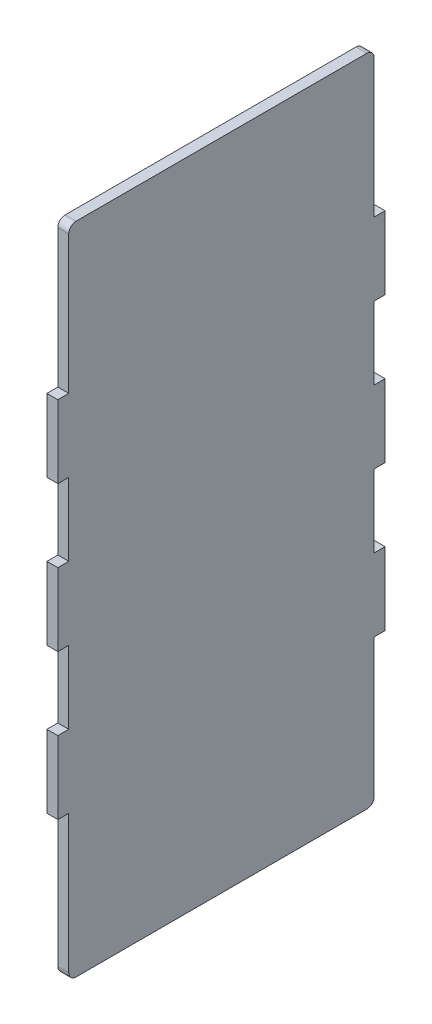
ISO-10303-21;
HEADER;
FILE_DESCRIPTION(('STEP AP214'),'2;1');
FILE_NAME('part.step','',(''),(''),'','','');
FILE_SCHEMA(('AUTOMOTIVE_DESIGN { 1 0 10303 214 1 1 1 1 }'));
ENDSEC;
DATA;
#1=APPLICATION_CONTEXT('core data for automotive mechanical design processes');
#2=APPLICATION_PROTOCOL_DEFINITION('international standard','automotive_design',2000,#1);
#3=PRODUCT_CONTEXT('',#1,'mechanical');
#4=PRODUCT('Part','Part','',(#3));
#5=PRODUCT_RELATED_PRODUCT_CATEGORY('part','',(#4));
#6=PRODUCT_DEFINITION_FORMATION('','',#4);
#7=PRODUCT_DEFINITION_CONTEXT('part definition',#1,'design');
#8=PRODUCT_DEFINITION('design','',#6,#7);
#9=PRODUCT_DEFINITION_SHAPE('','',#8);
#10=(LENGTH_UNIT() NAMED_UNIT(*) SI_UNIT(.MILLI.,.METRE.));
#11=(NAMED_UNIT(*) PLANE_ANGLE_UNIT() SI_UNIT($,.RADIAN.));
#12=(NAMED_UNIT(*) SI_UNIT($,.STERADIAN.) SOLID_ANGLE_UNIT());
#13=UNCERTAINTY_MEASURE_WITH_UNIT(LENGTH_MEASURE(1.E-05),#10,'distance_accuracy_value','');
#14=(GEOMETRIC_REPRESENTATION_CONTEXT(3) GLOBAL_UNCERTAINTY_ASSIGNED_CONTEXT((#13)) GLOBAL_UNIT_ASSIGNED_CONTEXT((#10,
#11,#12)) REPRESENTATION_CONTEXT('',''));
#15=CARTESIAN_POINT('',(0.,0.,0.));
#16=DIRECTION('',(0.,0.,1.));
#17=DIRECTION('',(1.,0.,0.));
#18=AXIS2_PLACEMENT_3D('',#15,#16,#17);
#19=CARTESIAN_POINT('',(0.,0.,1.5));
#20=DIRECTION('',(0.,0.,-1.));
#21=DIRECTION('',(-1.,0.,0.));
#22=AXIS2_PLACEMENT_3D('',#19,#20,#21);
#23=PLANE('',#22);
#24=DIRECTION('',(0.,-1.,0.));
#25=VECTOR('',#24,1.);
#26=CARTESIAN_POINT('',(-90.9148936170213,114.397705984735,1.5));
#27=LINE('',#26,#25);
#28=CARTESIAN_POINT('',(-90.9148936170212,74.3977059847353,1.5));
#29=VERTEX_POINT('',#28);
#30=CARTESIAN_POINT('',(-90.9148936170212,54.3977059847353,1.5));
#31=VERTEX_POINT('',#30);
#32=EDGE_CURVE('E410',#29,#31,#27,.T.);
#33=ORIENTED_EDGE('',*,*,#32,.F.);
#34=DIRECTION('',(1.,0.,0.));
#35=VECTOR('',#34,1.);
#36=CARTESIAN_POINT('',(-94.0048936170213,74.3977059847353,1.5));
#37=LINE('',#36,#35);
#38=CARTESIAN_POINT('',(-93.9148936170212,74.3977059847353,1.5));
#39=VERTEX_POINT('',#38);
#40=EDGE_CURVE('E313',#39,#29,#37,.T.);
#41=ORIENTED_EDGE('',*,*,#40,.F.);
#42=DIRECTION('',(0.,-1.,0.));
#43=VECTOR('',#42,1.);
#44=CARTESIAN_POINT('',(-93.9148936170213,114.397705984735,1.5));
#45=LINE('',#44,#43);
#46=CARTESIAN_POINT('',(-93.9148936170212,54.3977059847353,1.5));
#47=VERTEX_POINT('',#46);
#48=EDGE_CURVE('E405',#39,#47,#45,.T.);
#49=ORIENTED_EDGE('',*,*,#48,.T.);
#50=DIRECTION('',(-1.,0.,0.));
#51=VECTOR('',#50,1.);
#52=CARTESIAN_POINT('',(-90.8248936170213,54.3977059847353,1.5));
#53=LINE('',#52,#51);
#54=EDGE_CURVE('E306',#31,#47,#53,.T.);
#55=ORIENTED_EDGE('',*,*,#54,.F.);
#56=EDGE_LOOP('',(#33,#41,#49,#55));
#57=FACE_BOUND('',#56,.T.);
#58=ADVANCED_FACE('F33',(#57),#23,.F.);
#59=CARTESIAN_POINT('',(-93.9148936170212,34.3977059847353,1.5));
#60=VERTEX_POINT('',#59);
#61=CARTESIAN_POINT('',(-93.9148936170212,14.3977059847353,1.5));
#62=VERTEX_POINT('',#61);
#63=EDGE_CURVE('E404',#60,#62,#45,.T.);
#64=ORIENTED_EDGE('',*,*,#63,.T.);
#65=DIRECTION('',(-1.,0.,0.));
#66=VECTOR('',#65,1.);
#67=CARTESIAN_POINT('',(-90.8248936170212,14.3977059847353,1.5));
#68=LINE('',#67,#66);
#69=CARTESIAN_POINT('',(-90.9148936170212,14.3977059847353,1.5));
#70=VERTEX_POINT('',#69);
#71=EDGE_CURVE('E301',#70,#62,#68,.T.);
#72=ORIENTED_EDGE('',*,*,#71,.F.);
#73=CARTESIAN_POINT('',(-90.9148936170212,34.3977059847353,1.5));
#74=VERTEX_POINT('',#73);
#75=EDGE_CURVE('E409',#74,#70,#27,.T.);
#76=ORIENTED_EDGE('',*,*,#75,.F.);
#77=DIRECTION('',(1.,0.,0.));
#78=VECTOR('',#77,1.);
#79=CARTESIAN_POINT('',(-94.0048936170212,34.3977059847353,1.5));
#80=LINE('',#79,#78);
#81=EDGE_CURVE('E304',#60,#74,#80,.T.);
#82=ORIENTED_EDGE('',*,*,#81,.F.);
#83=EDGE_LOOP('',(#64,#72,#76,#82));
#84=FACE_BOUND('',#83,.T.);
#85=ADVANCED_FACE('F528',(#84),#23,.F.);
#86=CARTESIAN_POINT('',(-90.9148936170212,-65.6022940152647,-268.52499826413));
#87=DIRECTION('',(0.,1.,0.));
#88=DIRECTION('',(0.,0.,1.));
#89=AXIS2_PLACEMENT_3D('',#86,#87,#88);
#90=PLANE('',#89);
#91=DIRECTION('',(0.,0.,1.));
#92=VECTOR('',#91,1.);
#93=CARTESIAN_POINT('',(-90.9148936170212,-65.6022940152647,-268.52499826413));
#94=LINE('',#93,#92);
#95=CARTESIAN_POINT('',(-90.9148936170212,-65.6022940152647,-83.5));
#96=VERTEX_POINT('',#95);
#97=CARTESIAN_POINT('',(-90.9148936170212,-65.6022940152647,-3.5));
#98=VERTEX_POINT('',#97);
#99=EDGE_CURVE('E415',#96,#98,#94,.T.);
#100=ORIENTED_EDGE('',*,*,#99,.T.);
#101=DIRECTION('',(1.,0.,0.));
#102=VECTOR('',#101,1.);
#103=CARTESIAN_POINT('',(-93.9148936170212,-65.6022940152647,-3.5));
#104=LINE('',#103,#102);
#105=CARTESIAN_POINT('',(-93.9148936170212,-65.6022940152647,-3.5));
#106=VERTEX_POINT('',#105);
#107=EDGE_CURVE('E442',#98,#106,#104,.F.);
#108=ORIENTED_EDGE('',*,*,#107,.T.);
#109=DIRECTION('',(0.,0.,1.));
#110=VECTOR('',#109,1.);
#111=CARTESIAN_POINT('',(-93.9148936170212,-65.6022940152647,-268.52499826413));
#112=LINE('',#111,#110);
#113=CARTESIAN_POINT('',(-93.9148936170212,-65.6022940152647,-83.5));
#114=VERTEX_POINT('',#113);
#115=EDGE_CURVE('E418',#114,#106,#112,.T.);
#116=ORIENTED_EDGE('',*,*,#115,.F.);
#117=DIRECTION('',(1.,0.,0.));
#118=VECTOR('',#117,1.);
#119=CARTESIAN_POINT('',(-90.9148936170212,-65.6022940152647,-83.5));
#120=LINE('',#119,#118);
#121=EDGE_CURVE('E439',#114,#96,#120,.T.);
#122=ORIENTED_EDGE('',*,*,#121,.T.);
#123=EDGE_LOOP('',(#100,#108,#116,#122));
#124=FACE_BOUND('',#123,.T.);
#125=ADVANCED_FACE('F535',(#124),#90,.F.);
#126=CARTESIAN_POINT('',(-90.9148936170213,114.397705984735,-268.52499826413));
#127=DIRECTION('',(-1.,0.,0.));
#128=DIRECTION('',(0.,-1.,0.));
#129=AXIS2_PLACEMENT_3D('',#126,#127,#128);
#130=PLANE('',#129);
#131=DIRECTION('',(0.,1.,0.));
#132=VECTOR('',#131,1.);
#133=CARTESIAN_POINT('',(-90.9148936170213,114.397705984735,-1.5));
#134=LINE('',#133,#132);
#135=CARTESIAN_POINT('',(-90.9148936170212,-63.6022940152647,-1.5));
#136=VERTEX_POINT('',#135);
#137=CARTESIAN_POINT('',(-90.9148936170212,-25.6022940152647,-1.5));
#138=VERTEX_POINT('',#137);
#139=EDGE_CURVE('E386',#136,#138,#134,.T.);
#140=ORIENTED_EDGE('',*,*,#139,.F.);
#141=CARTESIAN_POINT('',(-90.9148936170212,-63.6022940152647,-3.5));
#142=DIRECTION('',(-1.,0.,0.));
#143=DIRECTION('',(0.,-1.,0.));
#144=AXIS2_PLACEMENT_3D('',#141,#142,#143);
#145=CIRCLE('',#144,2.);
#146=EDGE_CURVE('E437',#136,#98,#145,.F.);
#147=ORIENTED_EDGE('',*,*,#146,.T.);
#148=ORIENTED_EDGE('',*,*,#99,.F.);
#149=CARTESIAN_POINT('',(-90.9148936170212,-63.6022940152647,-83.5));
#150=DIRECTION('',(-1.,0.,0.));
#151=DIRECTION('',(0.,-1.,0.));
#152=AXIS2_PLACEMENT_3D('',#149,#150,#151);
#153=CIRCLE('',#152,2.);
#154=CARTESIAN_POINT('',(-90.9148936170212,-63.6022940152647,-85.5));
#155=VERTEX_POINT('',#154);
#156=EDGE_CURVE('E435',#96,#155,#153,.F.);
#157=ORIENTED_EDGE('',*,*,#156,.T.);
#158=DIRECTION('',(0.,1.,0.));
#159=VECTOR('',#158,1.);
#160=CARTESIAN_POINT('',(-90.9148936170213,114.397705984735,-85.5));
#161=LINE('',#160,#159);
#162=CARTESIAN_POINT('',(-90.9148936170212,-25.6022940152647,-85.5));
#163=VERTEX_POINT('',#162);
#164=EDGE_CURVE('E391',#155,#163,#161,.T.);
#165=ORIENTED_EDGE('',*,*,#164,.T.);
#166=DIRECTION('',(0.,0.,-1.));
#167=VECTOR('',#166,1.);
#168=CARTESIAN_POINT('',(-90.9148936170212,-25.6022940152647,-268.52499826413));
#169=LINE('',#168,#167);
#170=CARTESIAN_POINT('',(-90.9148936170212,-25.6022940152647,-88.5));
#171=VERTEX_POINT('',#170);
#172=EDGE_CURVE('E351',#163,#171,#169,.T.);
#173=ORIENTED_EDGE('',*,*,#172,.T.);
#174=DIRECTION('',(0.,1.,0.));
#175=VECTOR('',#174,1.);
#176=CARTESIAN_POINT('',(-90.9148936170213,114.397705984735,-88.5));
#177=LINE('',#176,#175);
#178=CARTESIAN_POINT('',(-90.9148936170212,-5.60229401526467,-88.5));
#179=VERTEX_POINT('',#178);
#180=EDGE_CURVE('E397',#171,#179,#177,.T.);
#181=ORIENTED_EDGE('',*,*,#180,.T.);
#182=DIRECTION('',(0.,0.,1.));
#183=VECTOR('',#182,1.);
#184=CARTESIAN_POINT('',(-90.9148936170212,-5.60229401526467,-268.52499826413));
#185=LINE('',#184,#183);
#186=CARTESIAN_POINT('',(-90.9148936170212,-5.60229401526467,-85.5));
#187=VERTEX_POINT('',#186);
#188=EDGE_CURVE('E298',#179,#187,#185,.T.);
#189=ORIENTED_EDGE('',*,*,#188,.T.);
#190=CARTESIAN_POINT('',(-90.9148936170212,14.3977059847353,-85.5));
#191=VERTEX_POINT('',#190);
#192=EDGE_CURVE('E475',#187,#191,#161,.T.);
#193=ORIENTED_EDGE('',*,*,#192,.T.);
#194=DIRECTION('',(0.,0.,-1.));
#195=VECTOR('',#194,1.);
#196=CARTESIAN_POINT('',(-90.9148936170212,14.3977059847353,-268.52499826413));
#197=LINE('',#196,#195);
#198=CARTESIAN_POINT('',(-90.9148936170212,14.3977059847353,-88.5));
#199=VERTEX_POINT('',#198);
#200=EDGE_CURVE('E357',#191,#199,#197,.T.);
#201=ORIENTED_EDGE('',*,*,#200,.T.);
#202=CARTESIAN_POINT('',(-90.9148936170212,34.3977059847354,-88.5));
#203=VERTEX_POINT('',#202);
#204=EDGE_CURVE('E395',#199,#203,#177,.T.);
#205=ORIENTED_EDGE('',*,*,#204,.T.);
#206=DIRECTION('',(0.,0.,1.));
#207=VECTOR('',#206,1.);
#208=CARTESIAN_POINT('',(-90.9148936170212,34.3977059847354,-268.52499826413));
#209=LINE('',#208,#207);
#210=CARTESIAN_POINT('',(-90.9148936170212,34.3977059847353,-85.5));
#211=VERTEX_POINT('',#210);
#212=EDGE_CURVE('E354',#203,#211,#209,.T.);
#213=ORIENTED_EDGE('',*,*,#212,.T.);
#214=CARTESIAN_POINT('',(-90.9148936170212,54.3977059847353,-85.5));
#215=VERTEX_POINT('',#214);
#216=EDGE_CURVE('E390',#211,#215,#161,.T.);
#217=ORIENTED_EDGE('',*,*,#216,.T.);
#218=DIRECTION('',(0.,0.,-1.));
#219=VECTOR('',#218,1.);
#220=CARTESIAN_POINT('',(-90.9148936170212,54.3977059847353,-268.52499826413));
#221=LINE('',#220,#219);
#222=CARTESIAN_POINT('',(-90.9148936170212,54.3977059847353,-88.5));
#223=VERTEX_POINT('',#222);
#224=EDGE_CURVE('E250',#215,#223,#221,.T.);
#225=ORIENTED_EDGE('',*,*,#224,.T.);
#226=CARTESIAN_POINT('',(-90.9148936170212,74.3977059847353,-88.5));
#227=VERTEX_POINT('',#226);
#228=EDGE_CURVE('E392',#223,#227,#177,.T.);
#229=ORIENTED_EDGE('',*,*,#228,.T.);
#230=DIRECTION('',(0.,0.,1.));
#231=VECTOR('',#230,1.);
#232=CARTESIAN_POINT('',(-90.9148936170212,74.3977059847353,-268.52499826413));
#233=LINE('',#232,#231);
#234=CARTESIAN_POINT('',(-90.9148936170212,74.3977059847353,-85.5));
#235=VERTEX_POINT('',#234);
#236=EDGE_CURVE('E361',#227,#235,#233,.T.);
#237=ORIENTED_EDGE('',*,*,#236,.T.);
#238=CARTESIAN_POINT('',(-90.9148936170213,112.397705984735,-85.5));
#239=VERTEX_POINT('',#238);
#240=EDGE_CURVE('E387',#235,#239,#161,.T.);
#241=ORIENTED_EDGE('',*,*,#240,.T.);
#242=CARTESIAN_POINT('',(-90.9148936170213,112.397705984735,-83.5));
#243=DIRECTION('',(-1.,0.,0.));
#244=DIRECTION('',(0.,-1.,0.));
#245=AXIS2_PLACEMENT_3D('',#242,#243,#244);
#246=CIRCLE('',#245,2.);
#247=CARTESIAN_POINT('',(-90.9148936170213,114.397705984735,-83.5));
#248=VERTEX_POINT('',#247);
#249=EDGE_CURVE('E433',#239,#248,#246,.F.);
#250=ORIENTED_EDGE('',*,*,#249,.T.);
#251=DIRECTION('',(0.,0.,1.));
#252=VECTOR('',#251,1.);
#253=CARTESIAN_POINT('',(-90.9148936170213,114.397705984735,-268.52499826413));
#254=LINE('',#253,#252);
#255=CARTESIAN_POINT('',(-90.9148936170213,114.397705984735,-3.5));
#256=VERTEX_POINT('',#255);
#257=EDGE_CURVE('E412',#248,#256,#254,.T.);
#258=ORIENTED_EDGE('',*,*,#257,.T.);
#259=CARTESIAN_POINT('',(-90.9148936170213,112.397705984735,-3.5));
#260=DIRECTION('',(-1.,0.,0.));
#261=DIRECTION('',(0.,-1.,0.));
#262=AXIS2_PLACEMENT_3D('',#259,#260,#261);
#263=CIRCLE('',#262,2.);
#264=CARTESIAN_POINT('',(-90.9148936170213,112.397705984735,-1.5));
#265=VERTEX_POINT('',#264);
#266=EDGE_CURVE('E431',#256,#265,#263,.F.);
#267=ORIENTED_EDGE('',*,*,#266,.T.);
#268=CARTESIAN_POINT('',(-90.9148936170212,74.3977059847353,-1.5));
#269=VERTEX_POINT('',#268);
#270=EDGE_CURVE('E382',#269,#265,#134,.T.);
#271=ORIENTED_EDGE('',*,*,#270,.F.);
#272=DIRECTION('',(0.,0.,1.));
#273=VECTOR('',#272,1.);
#274=CARTESIAN_POINT('',(-90.9148936170212,74.3977059847353,-268.52499826413));
#275=LINE('',#274,#273);
#276=EDGE_CURVE('E379',#269,#29,#275,.T.);
#277=ORIENTED_EDGE('',*,*,#276,.T.);
#278=ORIENTED_EDGE('',*,*,#32,.T.);
#279=DIRECTION('',(0.,0.,-1.));
#280=VECTOR('',#279,1.);
#281=CARTESIAN_POINT('',(-90.9148936170212,54.3977059847353,-268.52499826413));
#282=LINE('',#281,#280);
#283=CARTESIAN_POINT('',(-90.9148936170212,54.3977059847353,-1.5));
#284=VERTEX_POINT('',#283);
#285=EDGE_CURVE('E376',#31,#284,#282,.T.);
#286=ORIENTED_EDGE('',*,*,#285,.T.);
#287=CARTESIAN_POINT('',(-90.9148936170212,34.3977059847353,-1.5));
#288=VERTEX_POINT('',#287);
#289=EDGE_CURVE('E385',#288,#284,#134,.T.);
#290=ORIENTED_EDGE('',*,*,#289,.F.);
#291=DIRECTION('',(0.,0.,1.));
#292=VECTOR('',#291,1.);
#293=CARTESIAN_POINT('',(-90.9148936170212,34.3977059847354,-268.52499826413));
#294=LINE('',#293,#292);
#295=EDGE_CURVE('E370',#288,#74,#294,.T.);
#296=ORIENTED_EDGE('',*,*,#295,.T.);
#297=ORIENTED_EDGE('',*,*,#75,.T.);
#298=DIRECTION('',(0.,0.,-1.));
#299=VECTOR('',#298,1.);
#300=CARTESIAN_POINT('',(-90.9148936170212,14.3977059847353,-268.52499826413));
#301=LINE('',#300,#299);
#302=CARTESIAN_POINT('',(-90.9148936170212,14.3977059847353,-1.5));
#303=VERTEX_POINT('',#302);
#304=EDGE_CURVE('E373',#70,#303,#301,.T.);
#305=ORIENTED_EDGE('',*,*,#304,.T.);
#306=CARTESIAN_POINT('',(-90.9148936170212,-5.60229401526467,-1.5));
#307=VERTEX_POINT('',#306);
#308=EDGE_CURVE('E558',#307,#303,#134,.T.);
#309=ORIENTED_EDGE('',*,*,#308,.F.);
#310=DIRECTION('',(0.,0.,1.));
#311=VECTOR('',#310,1.);
#312=CARTESIAN_POINT('',(-90.9148936170212,-5.60229401526467,-268.52499826413));
#313=LINE('',#312,#311);
#314=CARTESIAN_POINT('',(-90.9148936170212,-5.60229401526467,1.5));
#315=VERTEX_POINT('',#314);
#316=EDGE_CURVE('E364',#307,#315,#313,.T.);
#317=ORIENTED_EDGE('',*,*,#316,.T.);
#318=CARTESIAN_POINT('',(-90.9148936170212,-25.6022940152647,1.5));
#319=VERTEX_POINT('',#318);
#320=EDGE_CURVE('E406',#315,#319,#27,.T.);
#321=ORIENTED_EDGE('',*,*,#320,.T.);
#322=DIRECTION('',(0.,0.,-1.));
#323=VECTOR('',#322,1.);
#324=CARTESIAN_POINT('',(-90.9148936170212,-25.6022940152647,-268.52499826413));
#325=LINE('',#324,#323);
#326=EDGE_CURVE('E367',#319,#138,#325,.T.);
#327=ORIENTED_EDGE('',*,*,#326,.T.);
#328=EDGE_LOOP('',(#140,#147,#148,#157,#165,#173,#181,#189,#193,#201,#205,#213,#217,#225,#229,
#237,#241,#250,#258,#267,#271,#277,#278,#286,#290,#296,#297,#305,#309,#317,#321,#327));
#329=FACE_BOUND('',#328,.T.);
#330=ADVANCED_FACE('F462',(#329),#130,.F.);
#331=CARTESIAN_POINT('',(-93.9148936170213,114.397705984735,-268.52499826413));
#332=DIRECTION('',(0.,-1.,0.));
#333=DIRECTION('',(0.,0.,-1.));
#334=AXIS2_PLACEMENT_3D('',#331,#332,#333);
#335=PLANE('',#334);
#336=ORIENTED_EDGE('',*,*,#257,.F.);
#337=DIRECTION('',(-1.,0.,0.));
#338=VECTOR('',#337,1.);
#339=CARTESIAN_POINT('',(-93.9148936170213,114.397705984735,-83.5));
#340=LINE('',#339,#338);
#341=CARTESIAN_POINT('',(-93.9148936170213,114.397705984735,-83.5));
#342=VERTEX_POINT('',#341);
#343=EDGE_CURVE('E454',#248,#342,#340,.T.);
#344=ORIENTED_EDGE('',*,*,#343,.T.);
#345=DIRECTION('',(0.,0.,1.));
#346=VECTOR('',#345,1.);
#347=CARTESIAN_POINT('',(-93.9148936170213,114.397705984735,-268.52499826413));
#348=LINE('',#347,#346);
#349=CARTESIAN_POINT('',(-93.9148936170213,114.397705984735,-3.5));
#350=VERTEX_POINT('',#349);
#351=EDGE_CURVE('E396',#342,#350,#348,.T.);
#352=ORIENTED_EDGE('',*,*,#351,.T.);
#353=DIRECTION('',(-1.,0.,0.));
#354=VECTOR('',#353,1.);
#355=CARTESIAN_POINT('',(-90.9148936170213,114.397705984735,-3.5));
#356=LINE('',#355,#354);
#357=EDGE_CURVE('E452',#350,#256,#356,.F.);
#358=ORIENTED_EDGE('',*,*,#357,.T.);
#359=EDGE_LOOP('',(#336,#344,#352,#358));
#360=FACE_BOUND('',#359,.T.);
#361=ADVANCED_FACE('F466',(#360),#335,.F.);
#362=CARTESIAN_POINT('',(-93.9148936170213,114.397705984735,-268.52499826413));
#363=DIRECTION('',(-1.,0.,0.));
#364=DIRECTION('',(0.,-1.,0.));
#365=AXIS2_PLACEMENT_3D('',#362,#363,#364);
#366=PLANE('',#365);
#367=ORIENTED_EDGE('',*,*,#115,.T.);
#368=CARTESIAN_POINT('',(-93.9148936170212,-63.6022940152647,-3.5));
#369=DIRECTION('',(-1.,0.,0.));
#370=DIRECTION('',(0.,-1.,0.));
#371=AXIS2_PLACEMENT_3D('',#368,#369,#370);
#372=CIRCLE('',#371,2.);
#373=CARTESIAN_POINT('',(-93.9148936170212,-63.6022940152647,-1.5));
#374=VERTEX_POINT('',#373);
#375=EDGE_CURVE('E448',#106,#374,#372,.T.);
#376=ORIENTED_EDGE('',*,*,#375,.T.);
#377=DIRECTION('',(0.,-1.,0.));
#378=VECTOR('',#377,1.);
#379=CARTESIAN_POINT('',(-93.9148936170212,0.,-1.5));
#380=LINE('',#379,#378);
#381=CARTESIAN_POINT('',(-93.9148936170212,-25.6022940152647,-1.5));
#382=VERTEX_POINT('',#381);
#383=EDGE_CURVE('E335',#382,#374,#380,.T.);
#384=ORIENTED_EDGE('',*,*,#383,.F.);
#385=DIRECTION('',(0.,0.,1.));
#386=VECTOR('',#385,1.);
#387=CARTESIAN_POINT('',(-93.9148936170212,-25.6022940152647,1.5));
#388=LINE('',#387,#386);
#389=CARTESIAN_POINT('',(-93.9148936170212,-25.6022940152647,1.5));
#390=VERTEX_POINT('',#389);
#391=EDGE_CURVE('E332',#382,#390,#388,.T.);
#392=ORIENTED_EDGE('',*,*,#391,.T.);
#393=CARTESIAN_POINT('',(-93.9148936170212,-5.60229401526467,1.5));
#394=VERTEX_POINT('',#393);
#395=EDGE_CURVE('E401',#394,#390,#45,.T.);
#396=ORIENTED_EDGE('',*,*,#395,.F.);
#397=DIRECTION('',(0.,0.,-1.));
#398=VECTOR('',#397,1.);
#399=CARTESIAN_POINT('',(-93.9148936170212,-5.60229401526467,1.5));
#400=LINE('',#399,#398);
#401=CARTESIAN_POINT('',(-93.9148936170212,-5.60229401526467,-1.5));
#402=VERTEX_POINT('',#401);
#403=EDGE_CURVE('E329',#394,#402,#400,.T.);
#404=ORIENTED_EDGE('',*,*,#403,.T.);
#405=CARTESIAN_POINT('',(-93.9148936170212,14.3977059847353,-1.5));
#406=VERTEX_POINT('',#405);
#407=EDGE_CURVE('E565',#406,#402,#380,.T.);
#408=ORIENTED_EDGE('',*,*,#407,.F.);
#409=DIRECTION('',(0.,0.,1.));
#410=VECTOR('',#409,1.);
#411=CARTESIAN_POINT('',(-93.9148936170212,14.3977059847353,1.5));
#412=LINE('',#411,#410);
#413=EDGE_CURVE('E326',#406,#62,#412,.T.);
#414=ORIENTED_EDGE('',*,*,#413,.T.);
#415=ORIENTED_EDGE('',*,*,#63,.F.);
#416=DIRECTION('',(0.,0.,-1.));
#417=VECTOR('',#416,1.);
#418=CARTESIAN_POINT('',(-93.9148936170212,34.3977059847353,1.5));
#419=LINE('',#418,#417);
#420=CARTESIAN_POINT('',(-93.9148936170212,34.3977059847354,-1.5));
#421=VERTEX_POINT('',#420);
#422=EDGE_CURVE('E323',#60,#421,#419,.T.);
#423=ORIENTED_EDGE('',*,*,#422,.T.);
#424=CARTESIAN_POINT('',(-93.9148936170212,54.3977059847353,-1.5));
#425=VERTEX_POINT('',#424);
#426=EDGE_CURVE('E339',#425,#421,#380,.T.);
#427=ORIENTED_EDGE('',*,*,#426,.F.);
#428=DIRECTION('',(0.,0.,1.));
#429=VECTOR('',#428,1.);
#430=CARTESIAN_POINT('',(-93.9148936170212,54.3977059847353,1.5));
#431=LINE('',#430,#429);
#432=EDGE_CURVE('E317',#425,#47,#431,.T.);
#433=ORIENTED_EDGE('',*,*,#432,.T.);
#434=ORIENTED_EDGE('',*,*,#48,.F.);
#435=DIRECTION('',(0.,0.,-1.));
#436=VECTOR('',#435,1.);
#437=CARTESIAN_POINT('',(-93.9148936170212,74.3977059847353,1.5));
#438=LINE('',#437,#436);
#439=CARTESIAN_POINT('',(-93.9148936170212,74.3977059847353,-1.5));
#440=VERTEX_POINT('',#439);
#441=EDGE_CURVE('E320',#39,#440,#438,.T.);
#442=ORIENTED_EDGE('',*,*,#441,.T.);
#443=CARTESIAN_POINT('',(-93.9148936170212,112.397705984735,-1.5));
#444=VERTEX_POINT('',#443);
#445=EDGE_CURVE('E336',#444,#440,#380,.T.);
#446=ORIENTED_EDGE('',*,*,#445,.F.);
#447=CARTESIAN_POINT('',(-93.9148936170213,112.397705984735,-3.5));
#448=DIRECTION('',(-1.,0.,0.));
#449=DIRECTION('',(0.,-1.,0.));
#450=AXIS2_PLACEMENT_3D('',#447,#448,#449);
#451=CIRCLE('',#450,2.);
#452=EDGE_CURVE('E48',#444,#350,#451,.T.);
#453=ORIENTED_EDGE('',*,*,#452,.T.);
#454=ORIENTED_EDGE('',*,*,#351,.F.);
#455=CARTESIAN_POINT('',(-93.9148936170213,112.397705984735,-83.5));
#456=DIRECTION('',(-1.,0.,0.));
#457=DIRECTION('',(0.,-1.,0.));
#458=AXIS2_PLACEMENT_3D('',#455,#456,#457);
#459=CIRCLE('',#458,2.);
#460=CARTESIAN_POINT('',(-93.9148936170212,112.397705984735,-85.5));
#461=VERTEX_POINT('',#460);
#462=EDGE_CURVE('E56',#342,#461,#459,.T.);
#463=ORIENTED_EDGE('',*,*,#462,.T.);
#464=DIRECTION('',(0.,-1.,0.));
#465=VECTOR('',#464,1.);
#466=CARTESIAN_POINT('',(-93.9148936170212,0.,-85.5));
#467=LINE('',#466,#465);
#468=CARTESIAN_POINT('',(-93.9148936170212,74.3977059847353,-85.5));
#469=VERTEX_POINT('',#468);
#470=EDGE_CURVE('E262',#461,#469,#467,.T.);
#471=ORIENTED_EDGE('',*,*,#470,.T.);
#472=DIRECTION('',(0.,0.,-1.));
#473=VECTOR('',#472,1.);
#474=CARTESIAN_POINT('',(-93.9148936170212,74.3977059847353,-85.5));
#475=LINE('',#474,#473);
#476=CARTESIAN_POINT('',(-93.9148936170212,74.3977059847353,-88.5));
#477=VERTEX_POINT('',#476);
#478=EDGE_CURVE('E271',#469,#477,#475,.T.);
#479=ORIENTED_EDGE('',*,*,#478,.T.);
#480=DIRECTION('',(0.,1.,0.));
#481=VECTOR('',#480,1.);
#482=CARTESIAN_POINT('',(-93.9148936170213,114.397705984735,-88.5));
#483=LINE('',#482,#481);
#484=CARTESIAN_POINT('',(-93.9148936170212,54.3977059847353,-88.5));
#485=VERTEX_POINT('',#484);
#486=EDGE_CURVE('E270',#485,#477,#483,.T.);
#487=ORIENTED_EDGE('',*,*,#486,.F.);
#488=DIRECTION('',(0.,0.,1.));
#489=VECTOR('',#488,1.);
#490=CARTESIAN_POINT('',(-93.9148936170212,54.3977059847353,-85.5));
#491=LINE('',#490,#489);
#492=CARTESIAN_POINT('',(-93.9148936170212,54.3977059847353,-85.5));
#493=VERTEX_POINT('',#492);
#494=EDGE_CURVE('E247',#485,#493,#491,.T.);
#495=ORIENTED_EDGE('',*,*,#494,.T.);
#496=CARTESIAN_POINT('',(-93.9148936170212,34.3977059847353,-85.5));
#497=VERTEX_POINT('',#496);
#498=EDGE_CURVE('E257',#493,#497,#467,.T.);
#499=ORIENTED_EDGE('',*,*,#498,.T.);
#500=DIRECTION('',(0.,0.,-1.));
#501=VECTOR('',#500,1.);
#502=CARTESIAN_POINT('',(-93.9148936170212,34.3977059847353,-85.5));
#503=LINE('',#502,#501);
#504=CARTESIAN_POINT('',(-93.9148936170212,34.3977059847353,-88.5));
#505=VERTEX_POINT('',#504);
#506=EDGE_CURVE('E273',#497,#505,#503,.T.);
#507=ORIENTED_EDGE('',*,*,#506,.T.);
#508=CARTESIAN_POINT('',(-93.9148936170212,14.3977059847353,-88.5));
#509=VERTEX_POINT('',#508);
#510=EDGE_CURVE('E399',#509,#505,#483,.T.);
#511=ORIENTED_EDGE('',*,*,#510,.F.);
#512=DIRECTION('',(0.,0.,1.));
#513=VECTOR('',#512,1.);
#514=CARTESIAN_POINT('',(-93.9148936170212,14.3977059847353,-85.5));
#515=LINE('',#514,#513);
#516=CARTESIAN_POINT('',(-93.9148936170212,14.3977059847353,-85.5));
#517=VERTEX_POINT('',#516);
#518=EDGE_CURVE('E279',#509,#517,#515,.T.);
#519=ORIENTED_EDGE('',*,*,#518,.T.);
#520=CARTESIAN_POINT('',(-93.9148936170212,-5.60229401526467,-85.5));
#521=VERTEX_POINT('',#520);
#522=EDGE_CURVE('E263',#517,#521,#467,.T.);
#523=ORIENTED_EDGE('',*,*,#522,.T.);
#524=DIRECTION('',(0.,0.,-1.));
#525=VECTOR('',#524,1.);
#526=CARTESIAN_POINT('',(-93.9148936170212,-5.60229401526467,-85.5));
#527=LINE('',#526,#525);
#528=CARTESIAN_POINT('',(-93.9148936170212,-5.60229401526467,-88.5));
#529=VERTEX_POINT('',#528);
#530=EDGE_CURVE('E282',#521,#529,#527,.T.);
#531=ORIENTED_EDGE('',*,*,#530,.T.);
#532=CARTESIAN_POINT('',(-93.9148936170212,-25.6022940152647,-88.5));
#533=VERTEX_POINT('',#532);
#534=EDGE_CURVE('E400',#533,#529,#483,.T.);
#535=ORIENTED_EDGE('',*,*,#534,.F.);
#536=DIRECTION('',(0.,0.,1.));
#537=VECTOR('',#536,1.);
#538=CARTESIAN_POINT('',(-93.9148936170212,-25.6022940152647,-85.5));
#539=LINE('',#538,#537);
#540=CARTESIAN_POINT('',(-93.9148936170212,-25.6022940152647,-85.5));
#541=VERTEX_POINT('',#540);
#542=EDGE_CURVE('E285',#533,#541,#539,.T.);
#543=ORIENTED_EDGE('',*,*,#542,.T.);
#544=CARTESIAN_POINT('',(-93.9148936170212,-63.6022940152647,-85.5));
#545=VERTEX_POINT('',#544);
#546=EDGE_CURVE('E287',#541,#545,#467,.T.);
#547=ORIENTED_EDGE('',*,*,#546,.T.);
#548=CARTESIAN_POINT('',(-93.9148936170212,-63.6022940152647,-83.5));
#549=DIRECTION('',(-1.,0.,0.));
#550=DIRECTION('',(0.,-1.,0.));
#551=AXIS2_PLACEMENT_3D('',#548,#549,#550);
#552=CIRCLE('',#551,2.);
#553=EDGE_CURVE('E446',#545,#114,#552,.T.);
#554=ORIENTED_EDGE('',*,*,#553,.T.);
#555=EDGE_LOOP('',(#367,#376,#384,#392,#396,#404,#408,#414,#415,#423,#427,#433,#434,#442,#446,
#453,#454,#463,#471,#479,#487,#495,#499,#507,#511,#519,#523,#531,#535,#543,#547,#554));
#556=FACE_BOUND('',#555,.T.);
#557=ADVANCED_FACE('F267',(#556),#366,.T.);
#558=CARTESIAN_POINT('',(0.,0.,-88.5));
#559=DIRECTION('',(0.,0.,1.));
#560=DIRECTION('',(1.,0.,0.));
#561=AXIS2_PLACEMENT_3D('',#558,#559,#560);
#562=PLANE('',#561);
#563=ORIENTED_EDGE('',*,*,#486,.T.);
#564=DIRECTION('',(1.,0.,0.));
#565=VECTOR('',#564,1.);
#566=CARTESIAN_POINT('',(0.,74.3977059847353,-88.5));
#567=LINE('',#566,#565);
#568=EDGE_CURVE('E289',#477,#227,#567,.T.);
#569=ORIENTED_EDGE('',*,*,#568,.T.);
#570=ORIENTED_EDGE('',*,*,#228,.F.);
#571=DIRECTION('',(-1.,0.,0.));
#572=VECTOR('',#571,1.);
#573=CARTESIAN_POINT('',(0.,54.3977059847353,-88.5));
#574=LINE('',#573,#572);
#575=EDGE_CURVE('E426',#223,#485,#574,.T.);
#576=ORIENTED_EDGE('',*,*,#575,.T.);
#577=EDGE_LOOP('',(#563,#569,#570,#576));
#578=FACE_BOUND('',#577,.T.);
#579=ADVANCED_FACE('F473',(#578),#562,.F.);
#580=ORIENTED_EDGE('',*,*,#204,.F.);
#581=DIRECTION('',(-1.,0.,0.));
#582=VECTOR('',#581,1.);
#583=CARTESIAN_POINT('',(0.,14.3977059847352,-88.5));
#584=LINE('',#583,#582);
#585=EDGE_CURVE('E423',#199,#509,#584,.T.);
#586=ORIENTED_EDGE('',*,*,#585,.T.);
#587=ORIENTED_EDGE('',*,*,#510,.T.);
#588=DIRECTION('',(1.,0.,0.));
#589=VECTOR('',#588,1.);
#590=CARTESIAN_POINT('',(0.,34.3977059847353,-88.5));
#591=LINE('',#590,#589);
#592=EDGE_CURVE('E292',#505,#203,#591,.T.);
#593=ORIENTED_EDGE('',*,*,#592,.T.);
#594=EDGE_LOOP('',(#580,#586,#587,#593));
#595=FACE_BOUND('',#594,.T.);
#596=ADVANCED_FACE('F515',(#595),#562,.F.);
#597=ORIENTED_EDGE('',*,*,#395,.T.);
#598=DIRECTION('',(-1.,0.,0.));
#599=VECTOR('',#598,1.);
#600=CARTESIAN_POINT('',(-90.8248936170212,-25.6022940152647,1.5));
#601=LINE('',#600,#599);
#602=EDGE_CURVE('E309',#319,#390,#601,.T.);
#603=ORIENTED_EDGE('',*,*,#602,.F.);
#604=ORIENTED_EDGE('',*,*,#320,.F.);
#605=DIRECTION('',(1.,0.,0.));
#606=VECTOR('',#605,1.);
#607=CARTESIAN_POINT('',(-94.0048936170212,-5.60229401526467,1.5));
#608=LINE('',#607,#606);
#609=EDGE_CURVE('E302',#394,#315,#608,.T.);
#610=ORIENTED_EDGE('',*,*,#609,.F.);
#611=EDGE_LOOP('',(#597,#603,#604,#610));
#612=FACE_BOUND('',#611,.T.);
#613=ADVANCED_FACE('F531',(#612),#23,.F.);
#614=ORIENTED_EDGE('',*,*,#180,.F.);
#615=DIRECTION('',(-1.,0.,0.));
#616=VECTOR('',#615,1.);
#617=CARTESIAN_POINT('',(0.,-25.6022940152647,-88.5));
#618=LINE('',#617,#616);
#619=EDGE_CURVE('E420',#171,#533,#618,.T.);
#620=ORIENTED_EDGE('',*,*,#619,.T.);
#621=ORIENTED_EDGE('',*,*,#534,.T.);
#622=DIRECTION('',(1.,0.,0.));
#623=VECTOR('',#622,1.);
#624=CARTESIAN_POINT('',(0.,-5.60229401526467,-88.5));
#625=LINE('',#624,#623);
#626=EDGE_CURVE('E295',#529,#179,#625,.T.);
#627=ORIENTED_EDGE('',*,*,#626,.T.);
#628=EDGE_LOOP('',(#614,#620,#621,#627));
#629=FACE_BOUND('',#628,.T.);
#630=ADVANCED_FACE('F511',(#629),#562,.F.);
#631=CARTESIAN_POINT('',(-90.8248936170212,14.3977059847353,-88.5));
#632=DIRECTION('',(0.,1.,0.));
#633=DIRECTION('',(-1.,0.,0.));
#634=AXIS2_PLACEMENT_3D('',#631,#632,#633);
#635=PLANE('',#634);
#636=DIRECTION('',(-1.,0.,0.));
#637=VECTOR('',#636,1.);
#638=CARTESIAN_POINT('',(-90.8248936170212,14.3977059847353,-85.5));
#639=LINE('',#638,#637);
#640=EDGE_CURVE('E493',#191,#517,#639,.T.);
#641=ORIENTED_EDGE('',*,*,#640,.T.);
#642=ORIENTED_EDGE('',*,*,#518,.F.);
#643=ORIENTED_EDGE('',*,*,#585,.F.);
#644=ORIENTED_EDGE('',*,*,#200,.F.);
#645=EDGE_LOOP('',(#641,#642,#643,#644));
#646=FACE_BOUND('',#645,.T.);
#647=ADVANCED_FACE('F500',(#646),#635,.F.);
#648=CARTESIAN_POINT('',(-94.0048936170212,-5.60229401526467,-88.5));
#649=DIRECTION('',(0.,-1.,0.));
#650=DIRECTION('',(0.,0.,-1.));
#651=AXIS2_PLACEMENT_3D('',#648,#649,#650);
#652=PLANE('',#651);
#653=ORIENTED_EDGE('',*,*,#626,.F.);
#654=ORIENTED_EDGE('',*,*,#530,.F.);
#655=DIRECTION('',(1.,0.,0.));
#656=VECTOR('',#655,1.);
#657=CARTESIAN_POINT('',(-94.0048936170212,-5.60229401526467,-85.5));
#658=LINE('',#657,#656);
#659=EDGE_CURVE('E490',#521,#187,#658,.T.);
#660=ORIENTED_EDGE('',*,*,#659,.T.);
#661=ORIENTED_EDGE('',*,*,#188,.F.);
#662=EDGE_LOOP('',(#653,#654,#660,#661));
#663=FACE_BOUND('',#662,.T.);
#664=ADVANCED_FACE('F513',(#663),#652,.F.);
#665=CARTESIAN_POINT('',(0.,0.,-85.5));
#666=DIRECTION('',(0.,0.,1.));
#667=DIRECTION('',(1.,0.,0.));
#668=AXIS2_PLACEMENT_3D('',#665,#666,#667);
#669=PLANE('',#668);
#670=ORIENTED_EDGE('',*,*,#659,.F.);
#671=ORIENTED_EDGE('',*,*,#522,.F.);
#672=ORIENTED_EDGE('',*,*,#640,.F.);
#673=ORIENTED_EDGE('',*,*,#192,.F.);
#674=EDGE_LOOP('',(#670,#671,#672,#673));
#675=FACE_BOUND('',#674,.T.);
#676=ADVANCED_FACE('F503',(#675),#669,.F.);
#677=CARTESIAN_POINT('',(-90.8248936170212,-25.6022940152647,-88.5));
#678=DIRECTION('',(0.,1.,0.));
#679=DIRECTION('',(0.,0.,1.));
#680=AXIS2_PLACEMENT_3D('',#677,#678,#679);
#681=PLANE('',#680);
#682=DIRECTION('',(-1.,0.,0.));
#683=VECTOR('',#682,1.);
#684=CARTESIAN_POINT('',(-90.8248936170212,-25.6022940152647,-85.5));
#685=LINE('',#684,#683);
#686=EDGE_CURVE('E348',#163,#541,#685,.T.);
#687=ORIENTED_EDGE('',*,*,#686,.T.);
#688=ORIENTED_EDGE('',*,*,#542,.F.);
#689=ORIENTED_EDGE('',*,*,#619,.F.);
#690=ORIENTED_EDGE('',*,*,#172,.F.);
#691=EDGE_LOOP('',(#687,#688,#689,#690));
#692=FACE_BOUND('',#691,.T.);
#693=ADVANCED_FACE('F486',(#692),#681,.F.);
#694=ORIENTED_EDGE('',*,*,#164,.F.);
#695=DIRECTION('',(1.,0.,0.));
#696=VECTOR('',#695,1.);
#697=CARTESIAN_POINT('',(0.,-63.6022940152647,-85.5));
#698=LINE('',#697,#696);
#699=EDGE_CURVE('E450',#155,#545,#698,.F.);
#700=ORIENTED_EDGE('',*,*,#699,.T.);
#701=ORIENTED_EDGE('',*,*,#546,.F.);
#702=ORIENTED_EDGE('',*,*,#686,.F.);
#703=EDGE_LOOP('',(#694,#700,#701,#702));
#704=FACE_BOUND('',#703,.T.);
#705=ADVANCED_FACE('F488',(#704),#669,.F.);
#706=CARTESIAN_POINT('',(-90.8248936170212,54.3977059847353,-88.5));
#707=DIRECTION('',(0.,1.,0.));
#708=DIRECTION('',(0.,0.,1.));
#709=AXIS2_PLACEMENT_3D('',#706,#707,#708);
#710=PLANE('',#709);
#711=DIRECTION('',(-1.,0.,0.));
#712=VECTOR('',#711,1.);
#713=CARTESIAN_POINT('',(-90.8248936170212,54.3977059847353,-85.5));
#714=LINE('',#713,#712);
#715=EDGE_CURVE('E243',#215,#493,#714,.T.);
#716=ORIENTED_EDGE('',*,*,#715,.T.);
#717=ORIENTED_EDGE('',*,*,#494,.F.);
#718=ORIENTED_EDGE('',*,*,#575,.F.);
#719=ORIENTED_EDGE('',*,*,#224,.F.);
#720=EDGE_LOOP('',(#716,#717,#718,#719));
#721=FACE_BOUND('',#720,.T.);
#722=ADVANCED_FACE('F245',(#721),#710,.F.);
#723=CARTESIAN_POINT('',(-94.0048936170212,34.3977059847353,-88.5));
#724=DIRECTION('',(0.,-1.,0.));
#725=DIRECTION('',(0.,0.,-1.));
#726=AXIS2_PLACEMENT_3D('',#723,#724,#725);
#727=PLANE('',#726);
#728=ORIENTED_EDGE('',*,*,#592,.F.);
#729=ORIENTED_EDGE('',*,*,#506,.F.);
#730=DIRECTION('',(1.,0.,0.));
#731=VECTOR('',#730,1.);
#732=CARTESIAN_POINT('',(-94.0048936170212,34.3977059847353,-85.5));
#733=LINE('',#732,#731);
#734=EDGE_CURVE('E254',#497,#211,#733,.T.);
#735=ORIENTED_EDGE('',*,*,#734,.T.);
#736=ORIENTED_EDGE('',*,*,#212,.F.);
#737=EDGE_LOOP('',(#728,#729,#735,#736));
#738=FACE_BOUND('',#737,.T.);
#739=ADVANCED_FACE('F517',(#738),#727,.F.);
#740=ORIENTED_EDGE('',*,*,#734,.F.);
#741=ORIENTED_EDGE('',*,*,#498,.F.);
#742=ORIENTED_EDGE('',*,*,#715,.F.);
#743=ORIENTED_EDGE('',*,*,#216,.F.);
#744=EDGE_LOOP('',(#740,#741,#742,#743));
#745=FACE_BOUND('',#744,.T.);
#746=ADVANCED_FACE('F258',(#745),#669,.F.);
#747=ORIENTED_EDGE('',*,*,#470,.F.);
#748=DIRECTION('',(-1.,0.,0.));
#749=VECTOR('',#748,1.);
#750=CARTESIAN_POINT('',(0.,112.397705984735,-85.5));
#751=LINE('',#750,#749);
#752=EDGE_CURVE('E41',#461,#239,#751,.F.);
#753=ORIENTED_EDGE('',*,*,#752,.T.);
#754=ORIENTED_EDGE('',*,*,#240,.F.);
#755=DIRECTION('',(1.,0.,0.));
#756=VECTOR('',#755,1.);
#757=CARTESIAN_POINT('',(-94.0048936170212,74.3977059847353,-85.5));
#758=LINE('',#757,#756);
#759=EDGE_CURVE('E253',#469,#235,#758,.T.);
#760=ORIENTED_EDGE('',*,*,#759,.F.);
#761=EDGE_LOOP('',(#747,#753,#754,#760));
#762=FACE_BOUND('',#761,.T.);
#763=ADVANCED_FACE('F457',(#762),#669,.F.);
#764=CARTESIAN_POINT('',(-94.0048936170212,74.3977059847353,-88.5));
#765=DIRECTION('',(0.,-1.,0.));
#766=DIRECTION('',(0.,0.,-1.));
#767=AXIS2_PLACEMENT_3D('',#764,#765,#766);
#768=PLANE('',#767);
#769=ORIENTED_EDGE('',*,*,#568,.F.);
#770=ORIENTED_EDGE('',*,*,#478,.F.);
#771=ORIENTED_EDGE('',*,*,#759,.T.);
#772=ORIENTED_EDGE('',*,*,#236,.F.);
#773=EDGE_LOOP('',(#769,#770,#771,#772));
#774=FACE_BOUND('',#773,.T.);
#775=ADVANCED_FACE('F470',(#774),#768,.F.);
#776=CARTESIAN_POINT('',(-90.8248936170212,14.3977059847353,-1.5));
#777=DIRECTION('',(0.,1.,0.));
#778=DIRECTION('',(-1.,0.,0.));
#779=AXIS2_PLACEMENT_3D('',#776,#777,#778);
#780=PLANE('',#779);
#781=ORIENTED_EDGE('',*,*,#71,.T.);
#782=ORIENTED_EDGE('',*,*,#413,.F.);
#783=DIRECTION('',(-1.,0.,0.));
#784=VECTOR('',#783,1.);
#785=CARTESIAN_POINT('',(-90.8248936170212,14.3977059847353,-1.5));
#786=LINE('',#785,#784);
#787=EDGE_CURVE('E299',#303,#406,#786,.T.);
#788=ORIENTED_EDGE('',*,*,#787,.F.);
#789=ORIENTED_EDGE('',*,*,#304,.F.);
#790=EDGE_LOOP('',(#781,#782,#788,#789));
#791=FACE_BOUND('',#790,.T.);
#792=ADVANCED_FACE('F684',(#791),#780,.F.);
#793=CARTESIAN_POINT('',(-94.0048936170212,-5.60229401526467,-1.5));
#794=DIRECTION('',(0.,-1.,0.));
#795=DIRECTION('',(0.,0.,-1.));
#796=AXIS2_PLACEMENT_3D('',#793,#794,#795);
#797=PLANE('',#796);
#798=DIRECTION('',(1.,0.,0.));
#799=VECTOR('',#798,1.);
#800=CARTESIAN_POINT('',(0.,-5.60229401526467,-1.5));
#801=LINE('',#800,#799);
#802=EDGE_CURVE('E345',#402,#307,#801,.T.);
#803=ORIENTED_EDGE('',*,*,#802,.F.);
#804=ORIENTED_EDGE('',*,*,#403,.F.);
#805=ORIENTED_EDGE('',*,*,#609,.T.);
#806=ORIENTED_EDGE('',*,*,#316,.F.);
#807=EDGE_LOOP('',(#803,#804,#805,#806));
#808=FACE_BOUND('',#807,.T.);
#809=ADVANCED_FACE('F561',(#808),#797,.F.);
#810=CARTESIAN_POINT('',(0.,0.,-1.5));
#811=DIRECTION('',(0.,0.,1.));
#812=DIRECTION('',(1.,0.,0.));
#813=AXIS2_PLACEMENT_3D('',#810,#811,#812);
#814=PLANE('',#813);
#815=ORIENTED_EDGE('',*,*,#308,.T.);
#816=ORIENTED_EDGE('',*,*,#787,.T.);
#817=ORIENTED_EDGE('',*,*,#407,.T.);
#818=ORIENTED_EDGE('',*,*,#802,.T.);
#819=EDGE_LOOP('',(#815,#816,#817,#818));
#820=FACE_BOUND('',#819,.T.);
#821=ADVANCED_FACE('F563',(#820),#814,.T.);
#822=CARTESIAN_POINT('',(-90.8248936170212,-25.6022940152647,-1.5));
#823=DIRECTION('',(0.,1.,0.));
#824=DIRECTION('',(0.,0.,1.));
#825=AXIS2_PLACEMENT_3D('',#822,#823,#824);
#826=PLANE('',#825);
#827=ORIENTED_EDGE('',*,*,#602,.T.);
#828=ORIENTED_EDGE('',*,*,#391,.F.);
#829=DIRECTION('',(-1.,0.,0.));
#830=VECTOR('',#829,1.);
#831=CARTESIAN_POINT('',(-90.8248936170212,-25.6022940152647,-1.5));
#832=LINE('',#831,#830);
#833=EDGE_CURVE('E307',#138,#382,#832,.T.);
#834=ORIENTED_EDGE('',*,*,#833,.F.);
#835=ORIENTED_EDGE('',*,*,#326,.F.);
#836=EDGE_LOOP('',(#827,#828,#834,#835));
#837=FACE_BOUND('',#836,.T.);
#838=ADVANCED_FACE('F556',(#837),#826,.F.);
#839=ORIENTED_EDGE('',*,*,#383,.T.);
#840=DIRECTION('',(1.,0.,0.));
#841=VECTOR('',#840,1.);
#842=CARTESIAN_POINT('',(-90.9148936170212,-63.6022940152647,-1.5));
#843=LINE('',#842,#841);
#844=EDGE_CURVE('E428',#374,#136,#843,.T.);
#845=ORIENTED_EDGE('',*,*,#844,.T.);
#846=ORIENTED_EDGE('',*,*,#139,.T.);
#847=ORIENTED_EDGE('',*,*,#833,.T.);
#848=EDGE_LOOP('',(#839,#845,#846,#847));
#849=FACE_BOUND('',#848,.T.);
#850=ADVANCED_FACE('F569',(#849),#814,.T.);
#851=CARTESIAN_POINT('',(-90.8248936170213,54.3977059847353,-1.5));
#852=DIRECTION('',(0.,1.,0.));
#853=DIRECTION('',(0.,0.,1.));
#854=AXIS2_PLACEMENT_3D('',#851,#852,#853);
#855=PLANE('',#854);
#856=ORIENTED_EDGE('',*,*,#54,.T.);
#857=ORIENTED_EDGE('',*,*,#432,.F.);
#858=DIRECTION('',(-1.,0.,0.));
#859=VECTOR('',#858,1.);
#860=CARTESIAN_POINT('',(-90.8248936170213,54.3977059847353,-1.5));
#861=LINE('',#860,#859);
#862=EDGE_CURVE('E315',#284,#425,#861,.T.);
#863=ORIENTED_EDGE('',*,*,#862,.F.);
#864=ORIENTED_EDGE('',*,*,#285,.F.);
#865=EDGE_LOOP('',(#856,#857,#863,#864));
#866=FACE_BOUND('',#865,.T.);
#867=ADVANCED_FACE('F725',(#866),#855,.F.);
#868=CARTESIAN_POINT('',(-94.0048936170212,34.3977059847353,-1.5));
#869=DIRECTION('',(0.,-1.,0.));
#870=DIRECTION('',(0.,0.,-1.));
#871=AXIS2_PLACEMENT_3D('',#868,#869,#870);
#872=PLANE('',#871);
#873=DIRECTION('',(1.,0.,0.));
#874=VECTOR('',#873,1.);
#875=CARTESIAN_POINT('',(0.,34.3977059847353,-1.5));
#876=LINE('',#875,#874);
#877=EDGE_CURVE('E342',#421,#288,#876,.T.);
#878=ORIENTED_EDGE('',*,*,#877,.F.);
#879=ORIENTED_EDGE('',*,*,#422,.F.);
#880=ORIENTED_EDGE('',*,*,#81,.T.);
#881=ORIENTED_EDGE('',*,*,#295,.F.);
#882=EDGE_LOOP('',(#878,#879,#880,#881));
#883=FACE_BOUND('',#882,.T.);
#884=ADVANCED_FACE('F730',(#883),#872,.F.);
#885=ORIENTED_EDGE('',*,*,#289,.T.);
#886=ORIENTED_EDGE('',*,*,#862,.T.);
#887=ORIENTED_EDGE('',*,*,#426,.T.);
#888=ORIENTED_EDGE('',*,*,#877,.T.);
#889=EDGE_LOOP('',(#885,#886,#887,#888));
#890=FACE_BOUND('',#889,.T.);
#891=ADVANCED_FACE('F711',(#890),#814,.T.);
#892=ORIENTED_EDGE('',*,*,#270,.T.);
#893=DIRECTION('',(-1.,0.,0.));
#894=VECTOR('',#893,1.);
#895=CARTESIAN_POINT('',(-93.9148936170212,112.397705984735,-1.5));
#896=LINE('',#895,#894);
#897=EDGE_CURVE('E11',#265,#444,#896,.T.);
#898=ORIENTED_EDGE('',*,*,#897,.T.);
#899=ORIENTED_EDGE('',*,*,#445,.T.);
#900=DIRECTION('',(1.,0.,0.));
#901=VECTOR('',#900,1.);
#902=CARTESIAN_POINT('',(0.,74.3977059847353,-1.5));
#903=LINE('',#902,#901);
#904=EDGE_CURVE('E338',#440,#269,#903,.T.);
#905=ORIENTED_EDGE('',*,*,#904,.T.);
#906=EDGE_LOOP('',(#892,#898,#899,#905));
#907=FACE_BOUND('',#906,.T.);
#908=ADVANCED_FACE('F749',(#907),#814,.T.);
#909=CARTESIAN_POINT('',(-94.0048936170213,74.3977059847353,-1.5));
#910=DIRECTION('',(0.,-1.,0.));
#911=DIRECTION('',(0.,0.,-1.));
#912=AXIS2_PLACEMENT_3D('',#909,#910,#911);
#913=PLANE('',#912);
#914=ORIENTED_EDGE('',*,*,#904,.F.);
#915=ORIENTED_EDGE('',*,*,#441,.F.);
#916=ORIENTED_EDGE('',*,*,#40,.T.);
#917=ORIENTED_EDGE('',*,*,#276,.F.);
#918=EDGE_LOOP('',(#914,#915,#916,#917));
#919=FACE_BOUND('',#918,.T.);
#920=ADVANCED_FACE('F586',(#919),#913,.F.);
#921=CARTESIAN_POINT('',(0.,-63.6022940152647,-3.5));
#922=DIRECTION('',(-1.,0.,0.));
#923=DIRECTION('',(0.,0.,1.));
#924=AXIS2_PLACEMENT_3D('',#921,#922,#923);
#925=CYLINDRICAL_SURFACE('',#924,2.);
#926=ORIENTED_EDGE('',*,*,#375,.F.);
#927=ORIENTED_EDGE('',*,*,#107,.F.);
#928=ORIENTED_EDGE('',*,*,#146,.F.);
#929=ORIENTED_EDGE('',*,*,#844,.F.);
#930=EDGE_LOOP('',(#926,#927,#928,#929));
#931=FACE_BOUND('',#930,.T.);
#932=ADVANCED_FACE('F572',(#931),#925,.T.);
#933=CARTESIAN_POINT('',(-90.9148936170212,-63.6022940152647,-83.5));
#934=DIRECTION('',(1.,0.,0.));
#935=DIRECTION('',(0.,0.,-1.));
#936=AXIS2_PLACEMENT_3D('',#933,#934,#935);
#937=CYLINDRICAL_SURFACE('',#936,2.);
#938=ORIENTED_EDGE('',*,*,#553,.F.);
#939=ORIENTED_EDGE('',*,*,#699,.F.);
#940=ORIENTED_EDGE('',*,*,#156,.F.);
#941=ORIENTED_EDGE('',*,*,#121,.F.);
#942=EDGE_LOOP('',(#938,#939,#940,#941));
#943=FACE_BOUND('',#942,.T.);
#944=ADVANCED_FACE('F579',(#943),#937,.T.);
#945=CARTESIAN_POINT('',(-93.9148936170213,112.397705984735,-83.5));
#946=DIRECTION('',(-1.,0.,0.));
#947=DIRECTION('',(0.,0.,1.));
#948=AXIS2_PLACEMENT_3D('',#945,#946,#947);
#949=CYLINDRICAL_SURFACE('',#948,2.);
#950=ORIENTED_EDGE('',*,*,#249,.F.);
#951=ORIENTED_EDGE('',*,*,#752,.F.);
#952=ORIENTED_EDGE('',*,*,#462,.F.);
#953=ORIENTED_EDGE('',*,*,#343,.F.);
#954=EDGE_LOOP('',(#950,#951,#952,#953));
#955=FACE_BOUND('',#954,.T.);
#956=ADVANCED_FACE('F464',(#955),#949,.T.);
#957=CARTESIAN_POINT('',(0.,112.397705984735,-3.5));
#958=DIRECTION('',(1.,0.,0.));
#959=DIRECTION('',(0.,0.,-1.));
#960=AXIS2_PLACEMENT_3D('',#957,#958,#959);
#961=CYLINDRICAL_SURFACE('',#960,2.);
#962=ORIENTED_EDGE('',*,*,#266,.F.);
#963=ORIENTED_EDGE('',*,*,#357,.F.);
#964=ORIENTED_EDGE('',*,*,#452,.F.);
#965=ORIENTED_EDGE('',*,*,#897,.F.);
#966=EDGE_LOOP('',(#962,#963,#964,#965));
#967=FACE_BOUND('',#966,.T.);
#968=ADVANCED_FACE('F35',(#967),#961,.T.);
#969=CLOSED_SHELL('',(#58,#85,#125,#330,#361,#557,#579,#596,#613,#630,#647,#664,#676,#693,#705,
#722,#739,#746,#763,#775,#792,#809,#821,#838,#850,#867,#884,#891,#908,#920,#932,#944,#956,#968));
#970=MANIFOLD_SOLID_BREP('B2',#969);
#971=ADVANCED_BREP_SHAPE_REPRESENTATION('',(#18,#970),#14);
#972=SHAPE_DEFINITION_REPRESENTATION(#9,#971);
ENDSEC;
END-ISO-10303-21;
